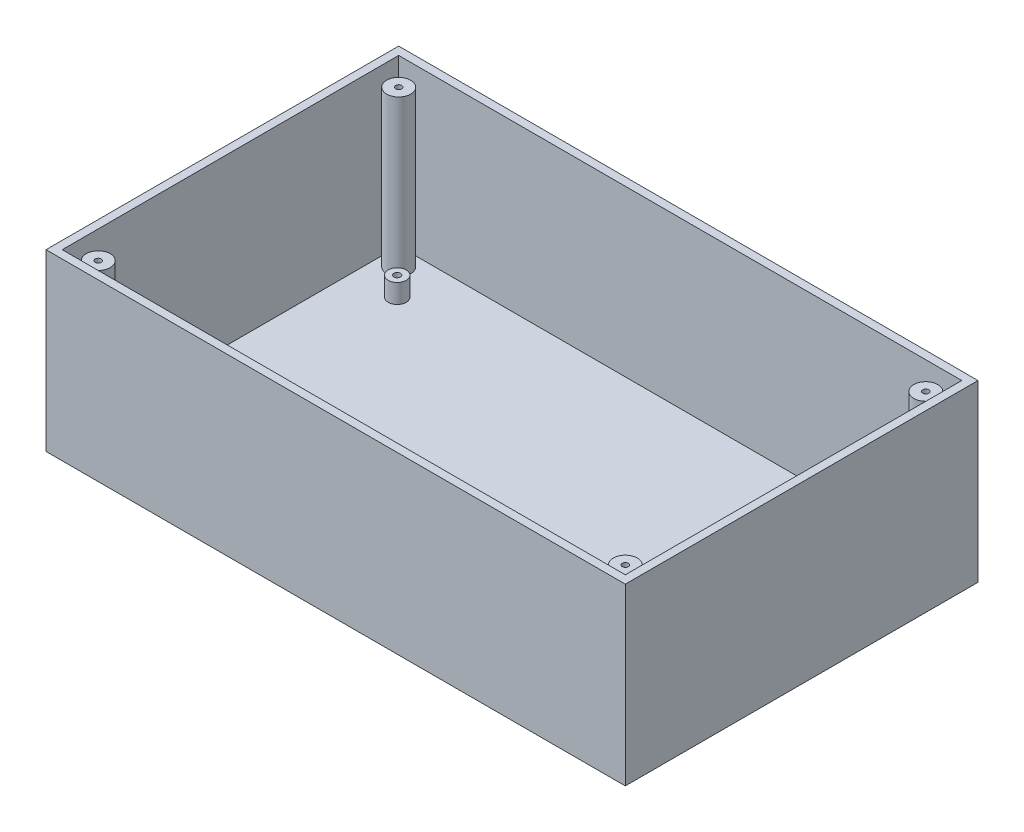
ISO-10303-21;
HEADER;
FILE_DESCRIPTION(('STEP AP214'),'2;1');
FILE_NAME('part.step','',(''),(''),'','','');
FILE_SCHEMA(('AUTOMOTIVE_DESIGN { 1 0 10303 214 1 1 1 1 }'));
ENDSEC;
DATA;
#1=APPLICATION_CONTEXT('core data for automotive mechanical design processes');
#2=APPLICATION_PROTOCOL_DEFINITION('international standard','automotive_design',2000,#1);
#3=PRODUCT_CONTEXT('',#1,'mechanical');
#4=PRODUCT('Part','Part','',(#3));
#5=PRODUCT_RELATED_PRODUCT_CATEGORY('part','',(#4));
#6=PRODUCT_DEFINITION_FORMATION('','',#4);
#7=PRODUCT_DEFINITION_CONTEXT('part definition',#1,'design');
#8=PRODUCT_DEFINITION('design','',#6,#7);
#9=PRODUCT_DEFINITION_SHAPE('','',#8);
#10=(LENGTH_UNIT() NAMED_UNIT(*) SI_UNIT(.MILLI.,.METRE.));
#11=(NAMED_UNIT(*) PLANE_ANGLE_UNIT() SI_UNIT($,.RADIAN.));
#12=(NAMED_UNIT(*) SI_UNIT($,.STERADIAN.) SOLID_ANGLE_UNIT());
#13=UNCERTAINTY_MEASURE_WITH_UNIT(LENGTH_MEASURE(1.E-05),#10,'distance_accuracy_value','');
#14=(GEOMETRIC_REPRESENTATION_CONTEXT(3) GLOBAL_UNCERTAINTY_ASSIGNED_CONTEXT((#13)) GLOBAL_UNIT_ASSIGNED_CONTEXT((#10,
#11,#12)) REPRESENTATION_CONTEXT('',''));
#15=CARTESIAN_POINT('',(0.,0.,0.));
#16=DIRECTION('',(0.,0.,1.));
#17=DIRECTION('',(1.,0.,0.));
#18=AXIS2_PLACEMENT_3D('',#15,#16,#17);
#19=CARTESIAN_POINT('',(0.,3.22,0.));
#20=DIRECTION('',(1.,0.,0.));
#21=DIRECTION('',(0.,0.,-1.));
#22=AXIS2_PLACEMENT_3D('',#19,#20,#21);
#23=PLANE('',#22);
#24=DIRECTION('',(0.,0.,1.));
#25=VECTOR('',#24,1.);
#26=CARTESIAN_POINT('',(0.,0.,0.));
#27=LINE('',#26,#25);
#28=CARTESIAN_POINT('',(0.,0.,-117.5));
#29=VERTEX_POINT('',#28);
#30=CARTESIAN_POINT('',(0.,0.,0.));
#31=VERTEX_POINT('',#30);
#32=EDGE_CURVE('E161',#29,#31,#27,.T.);
#33=ORIENTED_EDGE('',*,*,#32,.T.);
#34=DIRECTION('',(0.,-1.,0.));
#35=VECTOR('',#34,1.);
#36=CARTESIAN_POINT('',(0.,3.22,0.));
#37=LINE('',#36,#35);
#38=CARTESIAN_POINT('',(0.,58.22,0.));
#39=VERTEX_POINT('',#38);
#40=EDGE_CURVE('E176',#39,#31,#37,.T.);
#41=ORIENTED_EDGE('',*,*,#40,.F.);
#42=DIRECTION('',(0.,0.,1.));
#43=VECTOR('',#42,1.);
#44=CARTESIAN_POINT('',(0.,58.22,0.));
#45=LINE('',#44,#43);
#46=CARTESIAN_POINT('',(0.,58.22,-117.5));
#47=VERTEX_POINT('',#46);
#48=EDGE_CURVE('E124',#47,#39,#45,.T.);
#49=ORIENTED_EDGE('',*,*,#48,.F.);
#50=DIRECTION('',(0.,-1.,0.));
#51=VECTOR('',#50,1.);
#52=CARTESIAN_POINT('',(0.,3.22,-117.5));
#53=LINE('',#52,#51);
#54=EDGE_CURVE('E169',#47,#29,#53,.T.);
#55=ORIENTED_EDGE('',*,*,#54,.T.);
#56=EDGE_LOOP('',(#33,#41,#49,#55));
#57=FACE_BOUND('',#56,.T.);
#58=ADVANCED_FACE('F41',(#57),#23,.F.);
#59=CARTESIAN_POINT('',(0.,3.22,0.));
#60=DIRECTION('',(0.,0.,-1.));
#61=DIRECTION('',(-1.,0.,0.));
#62=AXIS2_PLACEMENT_3D('',#59,#60,#61);
#63=PLANE('',#62);
#64=DIRECTION('',(1.,0.,0.));
#65=VECTOR('',#64,1.);
#66=CARTESIAN_POINT('',(0.,0.,0.));
#67=LINE('',#66,#65);
#68=CARTESIAN_POINT('',(193.,0.,0.));
#69=VERTEX_POINT('',#68);
#70=EDGE_CURVE('E164',#31,#69,#67,.T.);
#71=ORIENTED_EDGE('',*,*,#70,.T.);
#72=DIRECTION('',(0.,-1.,0.));
#73=VECTOR('',#72,1.);
#74=CARTESIAN_POINT('',(193.,3.22,0.));
#75=LINE('',#74,#73);
#76=CARTESIAN_POINT('',(193.,58.22,0.));
#77=VERTEX_POINT('',#76);
#78=EDGE_CURVE('E173',#77,#69,#75,.T.);
#79=ORIENTED_EDGE('',*,*,#78,.F.);
#80=DIRECTION('',(1.,0.,0.));
#81=VECTOR('',#80,1.);
#82=CARTESIAN_POINT('',(0.,58.22,0.));
#83=LINE('',#82,#81);
#84=EDGE_CURVE('E152',#39,#77,#83,.T.);
#85=ORIENTED_EDGE('',*,*,#84,.F.);
#86=ORIENTED_EDGE('',*,*,#40,.T.);
#87=EDGE_LOOP('',(#71,#79,#85,#86));
#88=FACE_BOUND('',#87,.T.);
#89=ADVANCED_FACE('F237',(#88),#63,.F.);
#90=CARTESIAN_POINT('',(193.,3.22,0.));
#91=DIRECTION('',(-1.,0.,0.));
#92=DIRECTION('',(0.,0.,1.));
#93=AXIS2_PLACEMENT_3D('',#90,#91,#92);
#94=PLANE('',#93);
#95=DIRECTION('',(0.,0.,-1.));
#96=VECTOR('',#95,1.);
#97=CARTESIAN_POINT('',(193.,0.,0.));
#98=LINE('',#97,#96);
#99=CARTESIAN_POINT('',(193.,0.,-117.5));
#100=VERTEX_POINT('',#99);
#101=EDGE_CURVE('E166',#69,#100,#98,.T.);
#102=ORIENTED_EDGE('',*,*,#101,.T.);
#103=DIRECTION('',(0.,-1.,0.));
#104=VECTOR('',#103,1.);
#105=CARTESIAN_POINT('',(193.,3.22,-117.5));
#106=LINE('',#105,#104);
#107=CARTESIAN_POINT('',(193.,58.22,-117.5));
#108=VERTEX_POINT('',#107);
#109=EDGE_CURVE('E171',#108,#100,#106,.T.);
#110=ORIENTED_EDGE('',*,*,#109,.F.);
#111=DIRECTION('',(0.,0.,-1.));
#112=VECTOR('',#111,1.);
#113=CARTESIAN_POINT('',(193.,58.22,0.));
#114=LINE('',#113,#112);
#115=EDGE_CURVE('E155',#77,#108,#114,.T.);
#116=ORIENTED_EDGE('',*,*,#115,.F.);
#117=ORIENTED_EDGE('',*,*,#78,.T.);
#118=EDGE_LOOP('',(#102,#110,#116,#117));
#119=FACE_BOUND('',#118,.T.);
#120=ADVANCED_FACE('F242',(#119),#94,.F.);
#121=CARTESIAN_POINT('',(0.,3.22,-117.5));
#122=DIRECTION('',(0.,0.,1.));
#123=DIRECTION('',(1.,0.,0.));
#124=AXIS2_PLACEMENT_3D('',#121,#122,#123);
#125=PLANE('',#124);
#126=DIRECTION('',(-1.,0.,0.));
#127=VECTOR('',#126,1.);
#128=CARTESIAN_POINT('',(0.,0.,-117.5));
#129=LINE('',#128,#127);
#130=EDGE_CURVE('E64',#100,#29,#129,.T.);
#131=ORIENTED_EDGE('',*,*,#130,.T.);
#132=ORIENTED_EDGE('',*,*,#54,.F.);
#133=DIRECTION('',(-1.,0.,0.));
#134=VECTOR('',#133,1.);
#135=CARTESIAN_POINT('',(0.,58.22,-117.5));
#136=LINE('',#135,#134);
#137=EDGE_CURVE('E158',#108,#47,#136,.T.);
#138=ORIENTED_EDGE('',*,*,#137,.F.);
#139=ORIENTED_EDGE('',*,*,#109,.T.);
#140=EDGE_LOOP('',(#131,#132,#138,#139));
#141=FACE_BOUND('',#140,.T.);
#142=ADVANCED_FACE('F253',(#141),#125,.F.);
#143=CARTESIAN_POINT('',(0.,0.,0.));
#144=DIRECTION('',(0.,-1.,0.));
#145=DIRECTION('',(0.,0.,-1.));
#146=AXIS2_PLACEMENT_3D('',#143,#144,#145);
#147=PLANE('',#146);
#148=CARTESIAN_POINT('',(58.01,0.,-45.));
#149=DIRECTION('',(0.,1.,0.));
#150=DIRECTION('',(0.,0.,1.));
#151=AXIS2_PLACEMENT_3D('',#148,#149,#150);
#152=CIRCLE('',#151,3.37819999999999);
#153=CARTESIAN_POINT('',(58.01,0.,-41.6218));
#154=VERTEX_POINT('',#153);
#155=EDGE_CURVE('E633',#154,#154,#152,.T.);
#156=ORIENTED_EDGE('',*,*,#155,.T.);
#157=EDGE_LOOP('',(#156));
#158=FACE_BOUND('',#157,.T.);
#159=CARTESIAN_POINT('',(31.99,0.,-45.));
#160=DIRECTION('',(0.,1.,0.));
#161=DIRECTION('',(0.,0.,1.));
#162=AXIS2_PLACEMENT_3D('',#159,#160,#161);
#163=CIRCLE('',#162,3.37819999999999);
#164=CARTESIAN_POINT('',(31.99,0.,-41.6218));
#165=VERTEX_POINT('',#164);
#166=EDGE_CURVE('E643',#165,#165,#163,.T.);
#167=ORIENTED_EDGE('',*,*,#166,.T.);
#168=EDGE_LOOP('',(#167));
#169=FACE_BOUND('',#168,.T.);
#170=CARTESIAN_POINT('',(45.,0.,-45.));
#171=DIRECTION('',(0.,1.,0.));
#172=DIRECTION('',(0.,0.,1.));
#173=AXIS2_PLACEMENT_3D('',#170,#171,#172);
#174=CIRCLE('',#173,4.7625);
#175=CARTESIAN_POINT('',(45.,0.,-40.2375));
#176=VERTEX_POINT('',#175);
#177=EDGE_CURVE('E646',#176,#176,#174,.T.);
#178=ORIENTED_EDGE('',*,*,#177,.T.);
#179=EDGE_LOOP('',(#178));
#180=FACE_BOUND('',#179,.T.);
#181=ORIENTED_EDGE('',*,*,#32,.F.);
#182=ORIENTED_EDGE('',*,*,#130,.F.);
#183=ORIENTED_EDGE('',*,*,#101,.F.);
#184=ORIENTED_EDGE('',*,*,#70,.F.);
#185=EDGE_LOOP('',(#181,#182,#183,#184));
#186=FACE_BOUND('',#185,.T.);
#187=ADVANCED_FACE('F248',(#158,#169,#180,#186),#147,.T.);
#188=CARTESIAN_POINT('',(0.,58.22,0.));
#189=DIRECTION('',(0.,-1.,0.));
#190=DIRECTION('',(0.,0.,-1.));
#191=AXIS2_PLACEMENT_3D('',#188,#189,#190);
#192=PLANE('',#191);
#193=ORIENTED_EDGE('',*,*,#48,.T.);
#194=ORIENTED_EDGE('',*,*,#84,.T.);
#195=ORIENTED_EDGE('',*,*,#115,.T.);
#196=ORIENTED_EDGE('',*,*,#137,.T.);
#197=EDGE_LOOP('',(#193,#194,#195,#196));
#198=FACE_BOUND('',#197,.T.);
#199=DIRECTION('',(1.,0.,0.));
#200=VECTOR('',#199,1.);
#201=CARTESIAN_POINT('',(2.7,58.22,-2.7));
#202=LINE('',#201,#200);
#203=CARTESIAN_POINT('',(2.7,58.22,-2.7));
#204=VERTEX_POINT('',#203);
#205=CARTESIAN_POINT('',(190.3,58.22,-2.7));
#206=VERTEX_POINT('',#205);
#207=EDGE_CURVE('E108',#204,#206,#202,.T.);
#208=ORIENTED_EDGE('',*,*,#207,.F.);
#209=DIRECTION('',(0.,0.,1.));
#210=VECTOR('',#209,1.);
#211=CARTESIAN_POINT('',(2.7,58.22,-2.7));
#212=LINE('',#211,#210);
#213=CARTESIAN_POINT('',(2.7,58.22,-114.8));
#214=VERTEX_POINT('',#213);
#215=EDGE_CURVE('E132',#214,#204,#212,.T.);
#216=ORIENTED_EDGE('',*,*,#215,.F.);
#217=DIRECTION('',(-1.,0.,0.));
#218=VECTOR('',#217,1.);
#219=CARTESIAN_POINT('',(2.7,58.22,-114.8));
#220=LINE('',#219,#218);
#221=CARTESIAN_POINT('',(190.3,58.22,-114.8));
#222=VERTEX_POINT('',#221);
#223=EDGE_CURVE('E130',#222,#214,#220,.T.);
#224=ORIENTED_EDGE('',*,*,#223,.F.);
#225=DIRECTION('',(0.,0.,-1.));
#226=VECTOR('',#225,1.);
#227=CARTESIAN_POINT('',(190.3,58.22,-2.7));
#228=LINE('',#227,#226);
#229=EDGE_CURVE('E116',#206,#222,#228,.T.);
#230=ORIENTED_EDGE('',*,*,#229,.F.);
#231=EDGE_LOOP('',(#208,#216,#224,#230));
#232=FACE_BOUND('',#231,.T.);
#233=ADVANCED_FACE('F128',(#198,#232),#192,.F.);
#234=CARTESIAN_POINT('',(2.7,58.22,-2.7));
#235=DIRECTION('',(0.,0.,-1.));
#236=DIRECTION('',(-1.,0.,0.));
#237=AXIS2_PLACEMENT_3D('',#234,#235,#236);
#238=PLANE('',#237);
#239=DIRECTION('',(1.,0.,0.));
#240=VECTOR('',#239,1.);
#241=CARTESIAN_POINT('',(2.7,3.22,-2.7));
#242=LINE('',#241,#240);
#243=CARTESIAN_POINT('',(2.7,3.22,-2.7));
#244=VERTEX_POINT('',#243);
#245=CARTESIAN_POINT('',(190.3,3.22,-2.7));
#246=VERTEX_POINT('',#245);
#247=EDGE_CURVE('E137',#244,#246,#242,.T.);
#248=ORIENTED_EDGE('',*,*,#247,.F.);
#249=DIRECTION('',(0.,-1.,0.));
#250=VECTOR('',#249,1.);
#251=CARTESIAN_POINT('',(2.7,58.22,-2.7));
#252=LINE('',#251,#250);
#253=EDGE_CURVE('E56',#204,#244,#252,.T.);
#254=ORIENTED_EDGE('',*,*,#253,.F.);
#255=ORIENTED_EDGE('',*,*,#207,.T.);
#256=DIRECTION('',(0.,-1.,0.));
#257=VECTOR('',#256,1.);
#258=CARTESIAN_POINT('',(190.3,58.22,-2.7));
#259=LINE('',#258,#257);
#260=EDGE_CURVE('E111',#206,#246,#259,.T.);
#261=ORIENTED_EDGE('',*,*,#260,.T.);
#262=EDGE_LOOP('',(#248,#254,#255,#261));
#263=FACE_BOUND('',#262,.T.);
#264=ADVANCED_FACE('F110',(#263),#238,.T.);
#265=CARTESIAN_POINT('',(190.3,58.22,-2.7));
#266=DIRECTION('',(-1.,0.,0.));
#267=DIRECTION('',(0.,0.,1.));
#268=AXIS2_PLACEMENT_3D('',#265,#266,#267);
#269=PLANE('',#268);
#270=DIRECTION('',(0.,0.,-1.));
#271=VECTOR('',#270,1.);
#272=CARTESIAN_POINT('',(190.3,3.22,-2.7));
#273=LINE('',#272,#271);
#274=CARTESIAN_POINT('',(190.3,3.22,-114.8));
#275=VERTEX_POINT('',#274);
#276=EDGE_CURVE('E123',#246,#275,#273,.T.);
#277=ORIENTED_EDGE('',*,*,#276,.F.);
#278=ORIENTED_EDGE('',*,*,#260,.F.);
#279=ORIENTED_EDGE('',*,*,#229,.T.);
#280=DIRECTION('',(0.,-1.,0.));
#281=VECTOR('',#280,1.);
#282=CARTESIAN_POINT('',(190.3,58.22,-114.8));
#283=LINE('',#282,#281);
#284=EDGE_CURVE('E125',#222,#275,#283,.T.);
#285=ORIENTED_EDGE('',*,*,#284,.T.);
#286=EDGE_LOOP('',(#277,#278,#279,#285));
#287=FACE_BOUND('',#286,.T.);
#288=ADVANCED_FACE('F120',(#287),#269,.T.);
#289=CARTESIAN_POINT('',(2.7,58.22,-114.8));
#290=DIRECTION('',(0.,0.,1.));
#291=DIRECTION('',(1.,0.,0.));
#292=AXIS2_PLACEMENT_3D('',#289,#290,#291);
#293=PLANE('',#292);
#294=DIRECTION('',(-1.,0.,0.));
#295=VECTOR('',#294,1.);
#296=CARTESIAN_POINT('',(2.7,3.22,-114.8));
#297=LINE('',#296,#295);
#298=CARTESIAN_POINT('',(2.7,3.22,-114.8));
#299=VERTEX_POINT('',#298);
#300=EDGE_CURVE('E141',#275,#299,#297,.T.);
#301=ORIENTED_EDGE('',*,*,#300,.F.);
#302=ORIENTED_EDGE('',*,*,#284,.F.);
#303=ORIENTED_EDGE('',*,*,#223,.T.);
#304=DIRECTION('',(0.,-1.,0.));
#305=VECTOR('',#304,1.);
#306=CARTESIAN_POINT('',(2.7,58.22,-114.8));
#307=LINE('',#306,#305);
#308=EDGE_CURVE('E147',#214,#299,#307,.T.);
#309=ORIENTED_EDGE('',*,*,#308,.T.);
#310=EDGE_LOOP('',(#301,#302,#303,#309));
#311=FACE_BOUND('',#310,.T.);
#312=ADVANCED_FACE('F227',(#311),#293,.T.);
#313=CARTESIAN_POINT('',(2.7,58.22,-2.7));
#314=DIRECTION('',(1.,0.,0.));
#315=DIRECTION('',(0.,0.,-1.));
#316=AXIS2_PLACEMENT_3D('',#313,#314,#315);
#317=PLANE('',#316);
#318=DIRECTION('',(0.,0.,1.));
#319=VECTOR('',#318,1.);
#320=CARTESIAN_POINT('',(2.7,3.22,-2.7));
#321=LINE('',#320,#319);
#322=EDGE_CURVE('E117',#299,#244,#321,.T.);
#323=ORIENTED_EDGE('',*,*,#322,.F.);
#324=ORIENTED_EDGE('',*,*,#308,.F.);
#325=ORIENTED_EDGE('',*,*,#215,.T.);
#326=ORIENTED_EDGE('',*,*,#253,.T.);
#327=EDGE_LOOP('',(#323,#324,#325,#326));
#328=FACE_BOUND('',#327,.T.);
#329=ADVANCED_FACE('F206',(#328),#317,.T.);
#330=CARTESIAN_POINT('',(0.,3.22,0.));
#331=DIRECTION('',(0.,-1.,0.));
#332=DIRECTION('',(0.,0.,-1.));
#333=AXIS2_PLACEMENT_3D('',#330,#331,#332);
#334=PLANE('',#333);
#335=CARTESIAN_POINT('',(58.01,3.22,-45.));
#336=DIRECTION('',(0.,1.,0.));
#337=DIRECTION('',(0.,0.,1.));
#338=AXIS2_PLACEMENT_3D('',#335,#336,#337);
#339=CIRCLE('',#338,3.37819999999999);
#340=CARTESIAN_POINT('',(58.01,3.22,-41.6218));
#341=VERTEX_POINT('',#340);
#342=EDGE_CURVE('E636',#341,#341,#339,.T.);
#343=ORIENTED_EDGE('',*,*,#342,.F.);
#344=EDGE_LOOP('',(#343));
#345=FACE_BOUND('',#344,.T.);
#346=CARTESIAN_POINT('',(31.99,3.22,-45.));
#347=DIRECTION('',(0.,1.,0.));
#348=DIRECTION('',(0.,0.,1.));
#349=AXIS2_PLACEMENT_3D('',#346,#347,#348);
#350=CIRCLE('',#349,3.37819999999999);
#351=CARTESIAN_POINT('',(31.99,3.22,-41.6218));
#352=VERTEX_POINT('',#351);
#353=EDGE_CURVE('E638',#352,#352,#350,.T.);
#354=ORIENTED_EDGE('',*,*,#353,.F.);
#355=EDGE_LOOP('',(#354));
#356=FACE_BOUND('',#355,.T.);
#357=CARTESIAN_POINT('',(45.,3.22,-45.));
#358=DIRECTION('',(0.,-1.,0.));
#359=DIRECTION('',(0.,0.,-1.));
#360=AXIS2_PLACEMENT_3D('',#357,#358,#359);
#361=CIRCLE('',#360,4.7625);
#362=CARTESIAN_POINT('',(45.,3.22,-49.7625));
#363=VERTEX_POINT('',#362);
#364=EDGE_CURVE('E44',#363,#363,#361,.T.);
#365=ORIENTED_EDGE('',*,*,#364,.T.);
#366=EDGE_LOOP('',(#365));
#367=FACE_BOUND('',#366,.T.);
#368=CARTESIAN_POINT('',(8.69999999999998,3.22,-108.8));
#369=DIRECTION('',(0.,1.,0.));
#370=DIRECTION('',(0.,0.,1.));
#371=AXIS2_PLACEMENT_3D('',#368,#369,#370);
#372=CIRCLE('',#371,4.);
#373=CARTESIAN_POINT('',(8.69999999999998,3.22,-104.8));
#374=VERTEX_POINT('',#373);
#375=EDGE_CURVE('E653',#374,#374,#372,.F.);
#376=ORIENTED_EDGE('',*,*,#375,.T.);
#377=EDGE_LOOP('',(#376));
#378=FACE_BOUND('',#377,.T.);
#379=CARTESIAN_POINT('',(184.3,3.22,-108.8));
#380=DIRECTION('',(0.,-1.,0.));
#381=DIRECTION('',(0.,0.,-1.));
#382=AXIS2_PLACEMENT_3D('',#379,#380,#381);
#383=CIRCLE('',#382,4.00000000000001);
#384=CARTESIAN_POINT('',(184.3,3.22,-112.8));
#385=VERTEX_POINT('',#384);
#386=EDGE_CURVE('E49',#385,#385,#383,.F.);
#387=ORIENTED_EDGE('',*,*,#386,.F.);
#388=EDGE_LOOP('',(#387));
#389=FACE_BOUND('',#388,.T.);
#390=CARTESIAN_POINT('',(184.3,3.22,-8.69999999999997));
#391=DIRECTION('',(0.,1.,0.));
#392=DIRECTION('',(0.,0.,1.));
#393=AXIS2_PLACEMENT_3D('',#390,#391,#392);
#394=CIRCLE('',#393,3.99999999999999);
#395=CARTESIAN_POINT('',(184.3,3.22,-4.69999999999998));
#396=VERTEX_POINT('',#395);
#397=EDGE_CURVE('E214',#396,#396,#394,.F.);
#398=ORIENTED_EDGE('',*,*,#397,.T.);
#399=EDGE_LOOP('',(#398));
#400=FACE_BOUND('',#399,.T.);
#401=CARTESIAN_POINT('',(8.7,3.22,-8.7));
#402=DIRECTION('',(0.,-1.,0.));
#403=DIRECTION('',(0.,0.,-1.));
#404=AXIS2_PLACEMENT_3D('',#401,#402,#403);
#405=CIRCLE('',#404,4.);
#406=CARTESIAN_POINT('',(8.7,3.22,-12.7));
#407=VERTEX_POINT('',#406);
#408=EDGE_CURVE('E191',#407,#407,#405,.F.);
#409=ORIENTED_EDGE('',*,*,#408,.F.);
#410=EDGE_LOOP('',(#409));
#411=FACE_BOUND('',#410,.T.);
#412=CARTESIAN_POINT('',(175.8,3.22,-99.8));
#413=DIRECTION('',(0.,-1.,0.));
#414=DIRECTION('',(0.,0.,-1.));
#415=AXIS2_PLACEMENT_3D('',#412,#413,#414);
#416=CIRCLE('',#415,2.99999999999999);
#417=CARTESIAN_POINT('',(175.8,3.22,-102.8));
#418=VERTEX_POINT('',#417);
#419=EDGE_CURVE('E188',#418,#418,#416,.F.);
#420=ORIENTED_EDGE('',*,*,#419,.F.);
#421=EDGE_LOOP('',(#420));
#422=FACE_BOUND('',#421,.T.);
#423=CARTESIAN_POINT('',(17.2,3.22,-99.8));
#424=DIRECTION('',(0.,-1.,0.));
#425=DIRECTION('',(0.,0.,-1.));
#426=AXIS2_PLACEMENT_3D('',#423,#424,#425);
#427=CIRCLE('',#426,3.);
#428=CARTESIAN_POINT('',(17.2,3.22,-102.8));
#429=VERTEX_POINT('',#428);
#430=EDGE_CURVE('E185',#429,#429,#427,.F.);
#431=ORIENTED_EDGE('',*,*,#430,.F.);
#432=EDGE_LOOP('',(#431));
#433=FACE_BOUND('',#432,.T.);
#434=CARTESIAN_POINT('',(175.8,3.22,-17.7));
#435=DIRECTION('',(0.,-1.,0.));
#436=DIRECTION('',(0.,0.,-1.));
#437=AXIS2_PLACEMENT_3D('',#434,#435,#436);
#438=CIRCLE('',#437,2.99999999999999);
#439=CARTESIAN_POINT('',(175.8,3.22,-20.7));
#440=VERTEX_POINT('',#439);
#441=EDGE_CURVE('E182',#440,#440,#438,.F.);
#442=ORIENTED_EDGE('',*,*,#441,.F.);
#443=EDGE_LOOP('',(#442));
#444=FACE_BOUND('',#443,.T.);
#445=CARTESIAN_POINT('',(17.2,3.22,-17.7));
#446=DIRECTION('',(0.,-1.,0.));
#447=DIRECTION('',(0.,0.,-1.));
#448=AXIS2_PLACEMENT_3D('',#445,#446,#447);
#449=CIRCLE('',#448,3.);
#450=CARTESIAN_POINT('',(17.2,3.22,-20.7));
#451=VERTEX_POINT('',#450);
#452=EDGE_CURVE('E179',#451,#451,#449,.F.);
#453=ORIENTED_EDGE('',*,*,#452,.F.);
#454=EDGE_LOOP('',(#453));
#455=FACE_BOUND('',#454,.T.);
#456=ORIENTED_EDGE('',*,*,#322,.T.);
#457=ORIENTED_EDGE('',*,*,#247,.T.);
#458=ORIENTED_EDGE('',*,*,#276,.T.);
#459=ORIENTED_EDGE('',*,*,#300,.T.);
#460=EDGE_LOOP('',(#456,#457,#458,#459));
#461=FACE_BOUND('',#460,.T.);
#462=ADVANCED_FACE('F202',(#345,#356,#367,#378,#389,#400,#411,#422,#433,#444,#455,#461),#334,.F.);
#463=CARTESIAN_POINT('',(17.2,9.58,-17.7));
#464=DIRECTION('',(0.,1.,0.));
#465=DIRECTION('',(0.,0.,1.));
#466=AXIS2_PLACEMENT_3D('',#463,#464,#465);
#467=PLANE('',#466);
#468=CARTESIAN_POINT('',(17.2,9.58,-17.7));
#469=DIRECTION('',(0.,1.,0.));
#470=DIRECTION('',(0.,0.,1.));
#471=AXIS2_PLACEMENT_3D('',#468,#469,#470);
#472=CIRCLE('',#471,3.);
#473=CARTESIAN_POINT('',(17.2,9.58,-14.7));
#474=VERTEX_POINT('',#473);
#475=EDGE_CURVE('E139',#474,#474,#472,.T.);
#476=ORIENTED_EDGE('',*,*,#475,.T.);
#477=EDGE_LOOP('',(#476));
#478=FACE_BOUND('',#477,.T.);
#479=CARTESIAN_POINT('',(17.2,9.58,-17.7));
#480=DIRECTION('',(0.,1.,0.));
#481=DIRECTION('',(0.,0.,1.));
#482=AXIS2_PLACEMENT_3D('',#479,#480,#481);
#483=CIRCLE('',#482,1.1);
#484=CARTESIAN_POINT('',(17.2,9.58,-16.6));
#485=VERTEX_POINT('',#484);
#486=EDGE_CURVE('E711',#485,#485,#483,.T.);
#487=ORIENTED_EDGE('',*,*,#486,.F.);
#488=EDGE_LOOP('',(#487));
#489=FACE_BOUND('',#488,.T.);
#490=ADVANCED_FACE('F205',(#478,#489),#467,.T.);
#491=CARTESIAN_POINT('',(17.2,9.58,-17.7));
#492=DIRECTION('',(0.,-1.,0.));
#493=DIRECTION('',(0.,0.,-1.));
#494=AXIS2_PLACEMENT_3D('',#491,#492,#493);
#495=CYLINDRICAL_SURFACE('',#494,3.);
#496=ORIENTED_EDGE('',*,*,#475,.F.);
#497=EDGE_LOOP('',(#496));
#498=FACE_BOUND('',#497,.T.);
#499=ORIENTED_EDGE('',*,*,#452,.T.);
#500=EDGE_LOOP('',(#499));
#501=FACE_BOUND('',#500,.T.);
#502=ADVANCED_FACE('F298',(#498,#501),#495,.T.);
#503=CARTESIAN_POINT('',(17.2,9.58,-17.7));
#504=DIRECTION('',(0.,-1.,0.));
#505=DIRECTION('',(0.,0.,-1.));
#506=AXIS2_PLACEMENT_3D('',#503,#504,#505);
#507=CYLINDRICAL_SURFACE('',#506,1.1);
#508=ORIENTED_EDGE('',*,*,#486,.T.);
#509=EDGE_LOOP('',(#508));
#510=FACE_BOUND('',#509,.T.);
#511=CARTESIAN_POINT('',(17.2,3.22,-17.7));
#512=DIRECTION('',(0.,1.,0.));
#513=DIRECTION('',(0.,0.,1.));
#514=AXIS2_PLACEMENT_3D('',#511,#512,#513);
#515=CIRCLE('',#514,1.1);
#516=CARTESIAN_POINT('',(17.2,3.22,-16.6));
#517=VERTEX_POINT('',#516);
#518=EDGE_CURVE('E710',#517,#517,#515,.T.);
#519=ORIENTED_EDGE('',*,*,#518,.F.);
#520=EDGE_LOOP('',(#519));
#521=FACE_BOUND('',#520,.T.);
#522=ADVANCED_FACE('F309',(#510,#521),#507,.F.);
#523=ORIENTED_EDGE('',*,*,#518,.T.);
#524=EDGE_LOOP('',(#523));
#525=FACE_BOUND('',#524,.T.);
#526=ADVANCED_FACE('F210',(#525),#334,.F.);
#527=CARTESIAN_POINT('',(175.8,9.58,-17.7));
#528=DIRECTION('',(0.,-1.,0.));
#529=DIRECTION('',(0.,0.,-1.));
#530=AXIS2_PLACEMENT_3D('',#527,#528,#529);
#531=PLANE('',#530);
#532=CARTESIAN_POINT('',(175.8,9.58,-17.7));
#533=DIRECTION('',(0.,1.,0.));
#534=DIRECTION('',(0.,0.,-1.));
#535=AXIS2_PLACEMENT_3D('',#532,#533,#534);
#536=CIRCLE('',#535,2.99999999999999);
#537=CARTESIAN_POINT('',(175.8,9.58,-20.7));
#538=VERTEX_POINT('',#537);
#539=EDGE_CURVE('E705',#538,#538,#536,.T.);
#540=ORIENTED_EDGE('',*,*,#539,.T.);
#541=EDGE_LOOP('',(#540));
#542=FACE_BOUND('',#541,.T.);
#543=CARTESIAN_POINT('',(175.8,9.58,-17.7));
#544=DIRECTION('',(0.,1.,0.));
#545=DIRECTION('',(0.,0.,-1.));
#546=AXIS2_PLACEMENT_3D('',#543,#544,#545);
#547=CIRCLE('',#546,1.09999999999999);
#548=CARTESIAN_POINT('',(175.8,9.58,-18.8));
#549=VERTEX_POINT('',#548);
#550=EDGE_CURVE('E702',#549,#549,#547,.T.);
#551=ORIENTED_EDGE('',*,*,#550,.F.);
#552=EDGE_LOOP('',(#551));
#553=FACE_BOUND('',#552,.T.);
#554=ADVANCED_FACE('F328',(#542,#553),#531,.F.);
#555=CARTESIAN_POINT('',(175.8,9.58,-17.7));
#556=DIRECTION('',(0.,-1.,0.));
#557=DIRECTION('',(0.,0.,-1.));
#558=AXIS2_PLACEMENT_3D('',#555,#556,#557);
#559=CYLINDRICAL_SURFACE('',#558,2.99999999999999);
#560=ORIENTED_EDGE('',*,*,#539,.F.);
#561=EDGE_LOOP('',(#560));
#562=FACE_BOUND('',#561,.T.);
#563=ORIENTED_EDGE('',*,*,#441,.T.);
#564=EDGE_LOOP('',(#563));
#565=FACE_BOUND('',#564,.T.);
#566=ADVANCED_FACE('F338',(#562,#565),#559,.T.);
#567=CARTESIAN_POINT('',(175.8,9.58,-17.7));
#568=DIRECTION('',(0.,-1.,0.));
#569=DIRECTION('',(0.,0.,-1.));
#570=AXIS2_PLACEMENT_3D('',#567,#568,#569);
#571=CYLINDRICAL_SURFACE('',#570,1.09999999999999);
#572=ORIENTED_EDGE('',*,*,#550,.T.);
#573=EDGE_LOOP('',(#572));
#574=FACE_BOUND('',#573,.T.);
#575=CARTESIAN_POINT('',(175.8,3.22,-17.7));
#576=DIRECTION('',(0.,1.,0.));
#577=DIRECTION('',(0.,0.,-1.));
#578=AXIS2_PLACEMENT_3D('',#575,#576,#577);
#579=CIRCLE('',#578,1.09999999999999);
#580=CARTESIAN_POINT('',(175.8,3.22,-18.8));
#581=VERTEX_POINT('',#580);
#582=EDGE_CURVE('E701',#581,#581,#579,.T.);
#583=ORIENTED_EDGE('',*,*,#582,.F.);
#584=EDGE_LOOP('',(#583));
#585=FACE_BOUND('',#584,.T.);
#586=ADVANCED_FACE('F348',(#574,#585),#571,.F.);
#587=ORIENTED_EDGE('',*,*,#582,.T.);
#588=EDGE_LOOP('',(#587));
#589=FACE_BOUND('',#588,.T.);
#590=ADVANCED_FACE('F330',(#589),#334,.F.);
#591=CARTESIAN_POINT('',(17.2,9.58,-99.8));
#592=DIRECTION('',(0.,-1.,0.));
#593=DIRECTION('',(0.,0.,-1.));
#594=AXIS2_PLACEMENT_3D('',#591,#592,#593);
#595=PLANE('',#594);
#596=CARTESIAN_POINT('',(17.2,9.58,-99.8));
#597=DIRECTION('',(0.,1.,0.));
#598=DIRECTION('',(0.,0.,-1.));
#599=AXIS2_PLACEMENT_3D('',#596,#597,#598);
#600=CIRCLE('',#599,3.);
#601=CARTESIAN_POINT('',(17.2,9.58,-102.8));
#602=VERTEX_POINT('',#601);
#603=EDGE_CURVE('E696',#602,#602,#600,.T.);
#604=ORIENTED_EDGE('',*,*,#603,.T.);
#605=EDGE_LOOP('',(#604));
#606=FACE_BOUND('',#605,.T.);
#607=CARTESIAN_POINT('',(17.2,9.58,-99.8));
#608=DIRECTION('',(0.,1.,0.));
#609=DIRECTION('',(0.,0.,-1.));
#610=AXIS2_PLACEMENT_3D('',#607,#608,#609);
#611=CIRCLE('',#610,1.1);
#612=CARTESIAN_POINT('',(17.2,9.58,-100.9));
#613=VERTEX_POINT('',#612);
#614=EDGE_CURVE('E693',#613,#613,#611,.T.);
#615=ORIENTED_EDGE('',*,*,#614,.F.);
#616=EDGE_LOOP('',(#615));
#617=FACE_BOUND('',#616,.T.);
#618=ADVANCED_FACE('F367',(#606,#617),#595,.F.);
#619=CARTESIAN_POINT('',(17.2,9.58,-99.8));
#620=DIRECTION('',(0.,-1.,0.));
#621=DIRECTION('',(0.,0.,-1.));
#622=AXIS2_PLACEMENT_3D('',#619,#620,#621);
#623=CYLINDRICAL_SURFACE('',#622,3.);
#624=ORIENTED_EDGE('',*,*,#603,.F.);
#625=EDGE_LOOP('',(#624));
#626=FACE_BOUND('',#625,.T.);
#627=ORIENTED_EDGE('',*,*,#430,.T.);
#628=EDGE_LOOP('',(#627));
#629=FACE_BOUND('',#628,.T.);
#630=ADVANCED_FACE('F377',(#626,#629),#623,.T.);
#631=CARTESIAN_POINT('',(17.2,9.58,-99.8));
#632=DIRECTION('',(0.,-1.,0.));
#633=DIRECTION('',(0.,0.,-1.));
#634=AXIS2_PLACEMENT_3D('',#631,#632,#633);
#635=CYLINDRICAL_SURFACE('',#634,1.1);
#636=ORIENTED_EDGE('',*,*,#614,.T.);
#637=EDGE_LOOP('',(#636));
#638=FACE_BOUND('',#637,.T.);
#639=CARTESIAN_POINT('',(17.2,3.22,-99.8));
#640=DIRECTION('',(0.,1.,0.));
#641=DIRECTION('',(0.,0.,-1.));
#642=AXIS2_PLACEMENT_3D('',#639,#640,#641);
#643=CIRCLE('',#642,1.1);
#644=CARTESIAN_POINT('',(17.2,3.22,-100.9));
#645=VERTEX_POINT('',#644);
#646=EDGE_CURVE('E692',#645,#645,#643,.T.);
#647=ORIENTED_EDGE('',*,*,#646,.F.);
#648=EDGE_LOOP('',(#647));
#649=FACE_BOUND('',#648,.T.);
#650=ADVANCED_FACE('F387',(#638,#649),#635,.F.);
#651=ORIENTED_EDGE('',*,*,#646,.T.);
#652=EDGE_LOOP('',(#651));
#653=FACE_BOUND('',#652,.T.);
#654=ADVANCED_FACE('F369',(#653),#334,.F.);
#655=CARTESIAN_POINT('',(175.8,9.58,-99.8));
#656=DIRECTION('',(0.,1.,0.));
#657=DIRECTION('',(0.,0.,1.));
#658=AXIS2_PLACEMENT_3D('',#655,#656,#657);
#659=PLANE('',#658);
#660=CARTESIAN_POINT('',(175.8,9.58,-99.8));
#661=DIRECTION('',(0.,1.,0.));
#662=DIRECTION('',(0.,0.,1.));
#663=AXIS2_PLACEMENT_3D('',#660,#661,#662);
#664=CIRCLE('',#663,2.99999999999999);
#665=CARTESIAN_POINT('',(175.8,9.58,-96.8));
#666=VERTEX_POINT('',#665);
#667=EDGE_CURVE('E687',#666,#666,#664,.T.);
#668=ORIENTED_EDGE('',*,*,#667,.T.);
#669=EDGE_LOOP('',(#668));
#670=FACE_BOUND('',#669,.T.);
#671=CARTESIAN_POINT('',(175.8,9.58,-99.8));
#672=DIRECTION('',(0.,1.,0.));
#673=DIRECTION('',(0.,0.,1.));
#674=AXIS2_PLACEMENT_3D('',#671,#672,#673);
#675=CIRCLE('',#674,1.09999999999999);
#676=CARTESIAN_POINT('',(175.8,9.58,-98.7));
#677=VERTEX_POINT('',#676);
#678=EDGE_CURVE('E684',#677,#677,#675,.T.);
#679=ORIENTED_EDGE('',*,*,#678,.F.);
#680=EDGE_LOOP('',(#679));
#681=FACE_BOUND('',#680,.T.);
#682=ADVANCED_FACE('F406',(#670,#681),#659,.T.);
#683=CARTESIAN_POINT('',(175.8,9.58,-99.8));
#684=DIRECTION('',(0.,-1.,0.));
#685=DIRECTION('',(0.,0.,-1.));
#686=AXIS2_PLACEMENT_3D('',#683,#684,#685);
#687=CYLINDRICAL_SURFACE('',#686,2.99999999999999);
#688=ORIENTED_EDGE('',*,*,#667,.F.);
#689=EDGE_LOOP('',(#688));
#690=FACE_BOUND('',#689,.T.);
#691=ORIENTED_EDGE('',*,*,#419,.T.);
#692=EDGE_LOOP('',(#691));
#693=FACE_BOUND('',#692,.T.);
#694=ADVANCED_FACE('F415',(#690,#693),#687,.T.);
#695=CARTESIAN_POINT('',(175.8,9.58,-99.8));
#696=DIRECTION('',(0.,-1.,0.));
#697=DIRECTION('',(0.,0.,-1.));
#698=AXIS2_PLACEMENT_3D('',#695,#696,#697);
#699=CYLINDRICAL_SURFACE('',#698,1.09999999999999);
#700=ORIENTED_EDGE('',*,*,#678,.T.);
#701=EDGE_LOOP('',(#700));
#702=FACE_BOUND('',#701,.T.);
#703=CARTESIAN_POINT('',(175.8,3.22,-99.8));
#704=DIRECTION('',(0.,1.,0.));
#705=DIRECTION('',(0.,0.,1.));
#706=AXIS2_PLACEMENT_3D('',#703,#704,#705);
#707=CIRCLE('',#706,1.09999999999999);
#708=CARTESIAN_POINT('',(175.8,3.22,-98.7));
#709=VERTEX_POINT('',#708);
#710=EDGE_CURVE('E683',#709,#709,#707,.T.);
#711=ORIENTED_EDGE('',*,*,#710,.F.);
#712=EDGE_LOOP('',(#711));
#713=FACE_BOUND('',#712,.T.);
#714=ADVANCED_FACE('F425',(#702,#713),#699,.F.);
#715=ORIENTED_EDGE('',*,*,#710,.T.);
#716=EDGE_LOOP('',(#715));
#717=FACE_BOUND('',#716,.T.);
#718=ADVANCED_FACE('F408',(#717),#334,.F.);
#719=CARTESIAN_POINT('',(8.7,69.5337084989848,-8.7));
#720=DIRECTION('',(0.,-1.,0.));
#721=DIRECTION('',(0.,0.,-1.));
#722=AXIS2_PLACEMENT_3D('',#719,#720,#721);
#723=CYLINDRICAL_SURFACE('',#722,1.);
#724=CARTESIAN_POINT('',(8.7,55.06,-8.7));
#725=DIRECTION('',(0.,-1.,0.));
#726=DIRECTION('',(0.,0.,-1.));
#727=AXIS2_PLACEMENT_3D('',#724,#725,#726);
#728=CIRCLE('',#727,1.);
#729=CARTESIAN_POINT('',(8.7,55.06,-9.7));
#730=VERTEX_POINT('',#729);
#731=EDGE_CURVE('E675',#730,#730,#728,.T.);
#732=ORIENTED_EDGE('',*,*,#731,.F.);
#733=EDGE_LOOP('',(#732));
#734=FACE_BOUND('',#733,.T.);
#735=CARTESIAN_POINT('',(8.7,3.22,-8.7));
#736=DIRECTION('',(0.,1.,0.));
#737=DIRECTION('',(0.,0.,1.));
#738=AXIS2_PLACEMENT_3D('',#735,#736,#737);
#739=CIRCLE('',#738,1.);
#740=CARTESIAN_POINT('',(8.7,3.22,-7.7));
#741=VERTEX_POINT('',#740);
#742=EDGE_CURVE('E674',#741,#741,#739,.T.);
#743=ORIENTED_EDGE('',*,*,#742,.F.);
#744=EDGE_LOOP('',(#743));
#745=FACE_BOUND('',#744,.T.);
#746=ADVANCED_FACE('F444',(#734,#745),#723,.F.);
#747=CARTESIAN_POINT('',(8.7,69.5337084989848,-8.7));
#748=DIRECTION('',(0.,-1.,0.));
#749=DIRECTION('',(0.,0.,-1.));
#750=AXIS2_PLACEMENT_3D('',#747,#748,#749);
#751=CYLINDRICAL_SURFACE('',#750,4.);
#752=CARTESIAN_POINT('',(8.7,55.06,-8.7));
#753=DIRECTION('',(0.,-1.,0.));
#754=DIRECTION('',(0.,0.,-1.));
#755=AXIS2_PLACEMENT_3D('',#752,#753,#754);
#756=CIRCLE('',#755,4.);
#757=CARTESIAN_POINT('',(8.7,55.06,-12.7));
#758=VERTEX_POINT('',#757);
#759=EDGE_CURVE('E678',#758,#758,#756,.T.);
#760=ORIENTED_EDGE('',*,*,#759,.T.);
#761=EDGE_LOOP('',(#760));
#762=FACE_BOUND('',#761,.T.);
#763=ORIENTED_EDGE('',*,*,#408,.T.);
#764=EDGE_LOOP('',(#763));
#765=FACE_BOUND('',#764,.T.);
#766=ADVANCED_FACE('F455',(#762,#765),#751,.T.);
#767=CARTESIAN_POINT('',(0.,55.06,0.));
#768=DIRECTION('',(0.,-1.,0.));
#769=DIRECTION('',(0.,0.,-1.));
#770=AXIS2_PLACEMENT_3D('',#767,#768,#769);
#771=PLANE('',#770);
#772=ORIENTED_EDGE('',*,*,#731,.T.);
#773=EDGE_LOOP('',(#772));
#774=FACE_BOUND('',#773,.T.);
#775=ORIENTED_EDGE('',*,*,#759,.F.);
#776=EDGE_LOOP('',(#775));
#777=FACE_BOUND('',#776,.T.);
#778=ADVANCED_FACE('F467',(#774,#777),#771,.F.);
#779=ORIENTED_EDGE('',*,*,#742,.T.);
#780=EDGE_LOOP('',(#779));
#781=FACE_BOUND('',#780,.T.);
#782=ADVANCED_FACE('F446',(#781),#334,.F.);
#783=CARTESIAN_POINT('',(184.3,69.5337084989848,-8.69999999999997));
#784=DIRECTION('',(0.,-1.,0.));
#785=DIRECTION('',(0.,0.,-1.));
#786=AXIS2_PLACEMENT_3D('',#783,#784,#785);
#787=CYLINDRICAL_SURFACE('',#786,3.99999999999999);
#788=CARTESIAN_POINT('',(184.3,55.06,-8.69999999999997));
#789=DIRECTION('',(0.,-1.,0.));
#790=DIRECTION('',(0.,0.,-1.));
#791=AXIS2_PLACEMENT_3D('',#788,#789,#790);
#792=CIRCLE('',#791,3.99999999999999);
#793=CARTESIAN_POINT('',(184.3,55.06,-12.7));
#794=VERTEX_POINT('',#793);
#795=EDGE_CURVE('E667',#794,#794,#792,.F.);
#796=ORIENTED_EDGE('',*,*,#795,.F.);
#797=EDGE_LOOP('',(#796));
#798=FACE_BOUND('',#797,.T.);
#799=ORIENTED_EDGE('',*,*,#397,.F.);
#800=EDGE_LOOP('',(#799));
#801=FACE_BOUND('',#800,.T.);
#802=ADVANCED_FACE('F486',(#798,#801),#787,.T.);
#803=CARTESIAN_POINT('',(184.3,69.5337084989848,-8.69999999999997));
#804=DIRECTION('',(0.,-1.,0.));
#805=DIRECTION('',(0.,0.,-1.));
#806=AXIS2_PLACEMENT_3D('',#803,#804,#805);
#807=CYLINDRICAL_SURFACE('',#806,0.999999999999972);
#808=CARTESIAN_POINT('',(184.3,55.06,-8.69999999999997));
#809=DIRECTION('',(0.,-1.,0.));
#810=DIRECTION('',(0.,0.,-1.));
#811=AXIS2_PLACEMENT_3D('',#808,#809,#810);
#812=CIRCLE('',#811,0.999999999999972);
#813=CARTESIAN_POINT('',(184.3,55.06,-9.69999999999994));
#814=VERTEX_POINT('',#813);
#815=EDGE_CURVE('E670',#814,#814,#812,.F.);
#816=ORIENTED_EDGE('',*,*,#815,.T.);
#817=EDGE_LOOP('',(#816));
#818=FACE_BOUND('',#817,.T.);
#819=CARTESIAN_POINT('',(184.3,3.22,-8.69999999999997));
#820=DIRECTION('',(0.,-1.,0.));
#821=DIRECTION('',(0.,0.,-1.));
#822=AXIS2_PLACEMENT_3D('',#819,#820,#821);
#823=CIRCLE('',#822,0.999999999999972);
#824=CARTESIAN_POINT('',(184.3,3.22,-9.69999999999994));
#825=VERTEX_POINT('',#824);
#826=EDGE_CURVE('E194',#825,#825,#823,.T.);
#827=ORIENTED_EDGE('',*,*,#826,.T.);
#828=EDGE_LOOP('',(#827));
#829=FACE_BOUND('',#828,.T.);
#830=ADVANCED_FACE('F493',(#818,#829),#807,.F.);
#831=CARTESIAN_POINT('',(0.,55.06,0.));
#832=DIRECTION('',(0.,-1.,0.));
#833=DIRECTION('',(0.,0.,-1.));
#834=AXIS2_PLACEMENT_3D('',#831,#832,#833);
#835=PLANE('',#834);
#836=ORIENTED_EDGE('',*,*,#795,.T.);
#837=EDGE_LOOP('',(#836));
#838=FACE_BOUND('',#837,.T.);
#839=ORIENTED_EDGE('',*,*,#815,.F.);
#840=EDGE_LOOP('',(#839));
#841=FACE_BOUND('',#840,.T.);
#842=ADVANCED_FACE('F503',(#838,#841),#835,.F.);
#843=ORIENTED_EDGE('',*,*,#826,.F.);
#844=EDGE_LOOP('',(#843));
#845=FACE_BOUND('',#844,.T.);
#846=ADVANCED_FACE('F488',(#845),#334,.F.);
#847=CARTESIAN_POINT('',(184.3,69.5337084989848,-108.8));
#848=DIRECTION('',(0.,-1.,0.));
#849=DIRECTION('',(0.,0.,-1.));
#850=AXIS2_PLACEMENT_3D('',#847,#848,#849);
#851=CYLINDRICAL_SURFACE('',#850,0.999999999999998);
#852=CARTESIAN_POINT('',(184.3,55.06,-108.8));
#853=DIRECTION('',(0.,-1.,0.));
#854=DIRECTION('',(0.,0.,-1.));
#855=AXIS2_PLACEMENT_3D('',#852,#853,#854);
#856=CIRCLE('',#855,0.999999999999998);
#857=CARTESIAN_POINT('',(184.3,55.06,-109.8));
#858=VERTEX_POINT('',#857);
#859=EDGE_CURVE('E659',#858,#858,#856,.T.);
#860=ORIENTED_EDGE('',*,*,#859,.F.);
#861=EDGE_LOOP('',(#860));
#862=FACE_BOUND('',#861,.T.);
#863=CARTESIAN_POINT('',(184.3,3.22,-108.8));
#864=DIRECTION('',(0.,1.,0.));
#865=DIRECTION('',(0.,0.,1.));
#866=AXIS2_PLACEMENT_3D('',#863,#864,#865);
#867=CIRCLE('',#866,0.999999999999998);
#868=CARTESIAN_POINT('',(184.3,3.22,-107.8));
#869=VERTEX_POINT('',#868);
#870=EDGE_CURVE('E658',#869,#869,#867,.T.);
#871=ORIENTED_EDGE('',*,*,#870,.F.);
#872=EDGE_LOOP('',(#871));
#873=FACE_BOUND('',#872,.T.);
#874=ADVANCED_FACE('F523',(#862,#873),#851,.F.);
#875=CARTESIAN_POINT('',(184.3,69.5337084989848,-108.8));
#876=DIRECTION('',(0.,-1.,0.));
#877=DIRECTION('',(0.,0.,-1.));
#878=AXIS2_PLACEMENT_3D('',#875,#876,#877);
#879=CYLINDRICAL_SURFACE('',#878,4.00000000000001);
#880=CARTESIAN_POINT('',(184.3,55.06,-108.8));
#881=DIRECTION('',(0.,-1.,0.));
#882=DIRECTION('',(0.,0.,-1.));
#883=AXIS2_PLACEMENT_3D('',#880,#881,#882);
#884=CIRCLE('',#883,4.00000000000001);
#885=CARTESIAN_POINT('',(184.3,55.06,-112.8));
#886=VERTEX_POINT('',#885);
#887=EDGE_CURVE('E662',#886,#886,#884,.T.);
#888=ORIENTED_EDGE('',*,*,#887,.T.);
#889=EDGE_LOOP('',(#888));
#890=FACE_BOUND('',#889,.T.);
#891=ORIENTED_EDGE('',*,*,#386,.T.);
#892=EDGE_LOOP('',(#891));
#893=FACE_BOUND('',#892,.T.);
#894=ADVANCED_FACE('F200',(#890,#893),#879,.T.);
#895=CARTESIAN_POINT('',(0.,55.06,0.));
#896=DIRECTION('',(0.,-1.,0.));
#897=DIRECTION('',(0.,0.,-1.));
#898=AXIS2_PLACEMENT_3D('',#895,#896,#897);
#899=PLANE('',#898);
#900=ORIENTED_EDGE('',*,*,#859,.T.);
#901=EDGE_LOOP('',(#900));
#902=FACE_BOUND('',#901,.T.);
#903=ORIENTED_EDGE('',*,*,#887,.F.);
#904=EDGE_LOOP('',(#903));
#905=FACE_BOUND('',#904,.T.);
#906=ADVANCED_FACE('F540',(#902,#905),#899,.F.);
#907=ORIENTED_EDGE('',*,*,#870,.T.);
#908=EDGE_LOOP('',(#907));
#909=FACE_BOUND('',#908,.T.);
#910=ADVANCED_FACE('F525',(#909),#334,.F.);
#911=CARTESIAN_POINT('',(8.69999999999998,69.5337084989848,-108.8));
#912=DIRECTION('',(0.,-1.,0.));
#913=DIRECTION('',(0.,0.,-1.));
#914=AXIS2_PLACEMENT_3D('',#911,#912,#913);
#915=CYLINDRICAL_SURFACE('',#914,4.);
#916=CARTESIAN_POINT('',(8.69999999999998,55.06,-108.8));
#917=DIRECTION('',(0.,-1.,0.));
#918=DIRECTION('',(0.,0.,-1.));
#919=AXIS2_PLACEMENT_3D('',#916,#917,#918);
#920=CIRCLE('',#919,4.);
#921=CARTESIAN_POINT('',(8.69999999999998,55.06,-112.8));
#922=VERTEX_POINT('',#921);
#923=EDGE_CURVE('E649',#922,#922,#920,.F.);
#924=ORIENTED_EDGE('',*,*,#923,.F.);
#925=EDGE_LOOP('',(#924));
#926=FACE_BOUND('',#925,.T.);
#927=ORIENTED_EDGE('',*,*,#375,.F.);
#928=EDGE_LOOP('',(#927));
#929=FACE_BOUND('',#928,.T.);
#930=ADVANCED_FACE('F560',(#926,#929),#915,.T.);
#931=CARTESIAN_POINT('',(8.69999999999998,69.5337084989848,-108.8));
#932=DIRECTION('',(0.,-1.,0.));
#933=DIRECTION('',(0.,0.,-1.));
#934=AXIS2_PLACEMENT_3D('',#931,#932,#933);
#935=CYLINDRICAL_SURFACE('',#934,1.);
#936=CARTESIAN_POINT('',(8.69999999999998,55.06,-108.8));
#937=DIRECTION('',(0.,-1.,0.));
#938=DIRECTION('',(0.,0.,-1.));
#939=AXIS2_PLACEMENT_3D('',#936,#937,#938);
#940=CIRCLE('',#939,1.);
#941=CARTESIAN_POINT('',(8.69999999999998,55.06,-109.8));
#942=VERTEX_POINT('',#941);
#943=EDGE_CURVE('E652',#942,#942,#940,.F.);
#944=ORIENTED_EDGE('',*,*,#943,.T.);
#945=EDGE_LOOP('',(#944));
#946=FACE_BOUND('',#945,.T.);
#947=CARTESIAN_POINT('',(8.69999999999998,3.22,-108.8));
#948=DIRECTION('',(0.,-1.,0.));
#949=DIRECTION('',(0.,0.,-1.));
#950=AXIS2_PLACEMENT_3D('',#947,#948,#949);
#951=CIRCLE('',#950,1.);
#952=CARTESIAN_POINT('',(8.69999999999998,3.22,-109.8));
#953=VERTEX_POINT('',#952);
#954=EDGE_CURVE('E12',#953,#953,#951,.T.);
#955=ORIENTED_EDGE('',*,*,#954,.T.);
#956=EDGE_LOOP('',(#955));
#957=FACE_BOUND('',#956,.T.);
#958=ADVANCED_FACE('F565',(#946,#957),#935,.F.);
#959=CARTESIAN_POINT('',(0.,55.06,0.));
#960=DIRECTION('',(0.,-1.,0.));
#961=DIRECTION('',(0.,0.,-1.));
#962=AXIS2_PLACEMENT_3D('',#959,#960,#961);
#963=PLANE('',#962);
#964=ORIENTED_EDGE('',*,*,#923,.T.);
#965=EDGE_LOOP('',(#964));
#966=FACE_BOUND('',#965,.T.);
#967=ORIENTED_EDGE('',*,*,#943,.F.);
#968=EDGE_LOOP('',(#967));
#969=FACE_BOUND('',#968,.T.);
#970=ADVANCED_FACE('F575',(#966,#969),#963,.F.);
#971=ORIENTED_EDGE('',*,*,#954,.F.);
#972=EDGE_LOOP('',(#971));
#973=FACE_BOUND('',#972,.T.);
#974=ADVANCED_FACE('F209',(#973),#334,.F.);
#975=CARTESIAN_POINT('',(45.,0.,-45.));
#976=DIRECTION('',(0.,1.,0.));
#977=DIRECTION('',(0.,0.,1.));
#978=AXIS2_PLACEMENT_3D('',#975,#976,#977);
#979=CYLINDRICAL_SURFACE('',#978,4.7625);
#980=ORIENTED_EDGE('',*,*,#177,.F.);
#981=EDGE_LOOP('',(#980));
#982=FACE_BOUND('',#981,.T.);
#983=ORIENTED_EDGE('',*,*,#364,.F.);
#984=EDGE_LOOP('',(#983));
#985=FACE_BOUND('',#984,.T.);
#986=ADVANCED_FACE('F594',(#982,#985),#979,.F.);
#987=CARTESIAN_POINT('',(31.99,3.22,-45.));
#988=DIRECTION('',(0.,1.,0.));
#989=DIRECTION('',(0.,0.,1.));
#990=AXIS2_PLACEMENT_3D('',#987,#988,#989);
#991=CYLINDRICAL_SURFACE('',#990,3.37819999999999);
#992=ORIENTED_EDGE('',*,*,#166,.F.);
#993=EDGE_LOOP('',(#992));
#994=FACE_BOUND('',#993,.T.);
#995=ORIENTED_EDGE('',*,*,#353,.T.);
#996=EDGE_LOOP('',(#995));
#997=FACE_BOUND('',#996,.T.);
#998=ADVANCED_FACE('F599',(#994,#997),#991,.F.);
#999=CARTESIAN_POINT('',(58.01,3.22,-45.));
#1000=DIRECTION('',(0.,1.,0.));
#1001=DIRECTION('',(0.,0.,1.));
#1002=AXIS2_PLACEMENT_3D('',#999,#1000,#1001);
#1003=CYLINDRICAL_SURFACE('',#1002,3.37819999999999);
#1004=ORIENTED_EDGE('',*,*,#155,.F.);
#1005=EDGE_LOOP('',(#1004));
#1006=FACE_BOUND('',#1005,.T.);
#1007=ORIENTED_EDGE('',*,*,#342,.T.);
#1008=EDGE_LOOP('',(#1007));
#1009=FACE_BOUND('',#1008,.T.);
#1010=ADVANCED_FACE('F616',(#1006,#1009),#1003,.F.);
#1011=CLOSED_SHELL('',(#58,#89,#120,#142,#187,#233,#264,#288,#312,#329,#462,#490,#502,#522,#526,
#554,#566,#586,#590,#618,#630,#650,#654,#682,#694,#714,#718,#746,#766,#778,#782,#802,#830,#842,
#846,#874,#894,#906,#910,#930,#958,#970,#974,#986,#998,#1010));
#1012=MANIFOLD_SOLID_BREP('B2',#1011);
#1013=ADVANCED_BREP_SHAPE_REPRESENTATION('',(#18,#1012),#14);
#1014=SHAPE_DEFINITION_REPRESENTATION(#9,#1013);
ENDSEC;
END-ISO-10303-21;
